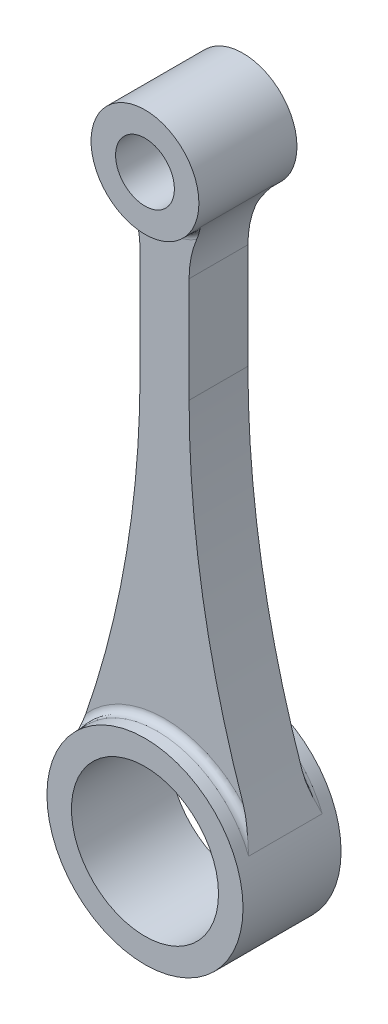
ISO-10303-21;
HEADER;
FILE_DESCRIPTION(('STEP AP214'),'2;1');
FILE_NAME('part.step','',(''),(''),'','','');
FILE_SCHEMA(('AUTOMOTIVE_DESIGN { 1 0 10303 214 1 1 1 1 }'));
ENDSEC;
DATA;
#1=APPLICATION_CONTEXT('core data for automotive mechanical design processes');
#2=APPLICATION_PROTOCOL_DEFINITION('international standard','automotive_design',2000,#1);
#3=PRODUCT_CONTEXT('',#1,'mechanical');
#4=PRODUCT('Part','Part','',(#3));
#5=PRODUCT_RELATED_PRODUCT_CATEGORY('part','',(#4));
#6=PRODUCT_DEFINITION_FORMATION('','',#4);
#7=PRODUCT_DEFINITION_CONTEXT('part definition',#1,'design');
#8=PRODUCT_DEFINITION('design','',#6,#7);
#9=PRODUCT_DEFINITION_SHAPE('','',#8);
#10=(LENGTH_UNIT() NAMED_UNIT(*) SI_UNIT(.MILLI.,.METRE.));
#11=(NAMED_UNIT(*) PLANE_ANGLE_UNIT() SI_UNIT($,.RADIAN.));
#12=(NAMED_UNIT(*) SI_UNIT($,.STERADIAN.) SOLID_ANGLE_UNIT());
#13=UNCERTAINTY_MEASURE_WITH_UNIT(LENGTH_MEASURE(1.E-05),#10,'distance_accuracy_value','');
#14=(GEOMETRIC_REPRESENTATION_CONTEXT(3) GLOBAL_UNCERTAINTY_ASSIGNED_CONTEXT((#13)) GLOBAL_UNIT_ASSIGNED_CONTEXT((#10,
#11,#12)) REPRESENTATION_CONTEXT('',''));
#15=CARTESIAN_POINT('',(0.,0.,0.));
#16=DIRECTION('',(0.,0.,1.));
#17=DIRECTION('',(1.,0.,0.));
#18=AXIS2_PLACEMENT_3D('',#15,#16,#17);
#19=CARTESIAN_POINT('',(0.,0.,10.));
#20=DIRECTION('',(0.,0.,1.));
#21=DIRECTION('',(1.,0.,0.));
#22=AXIS2_PLACEMENT_3D('',#19,#20,#21);
#23=PLANE('',#22);
#24=CARTESIAN_POINT('',(0.,0.,10.));
#25=DIRECTION('',(0.,0.,1.));
#26=DIRECTION('',(1.,0.,0.));
#27=AXIS2_PLACEMENT_3D('',#24,#25,#26);
#28=CIRCLE('',#27,20.);
#29=CARTESIAN_POINT('',(20.,0.,10.));
#30=VERTEX_POINT('',#29);
#31=EDGE_CURVE('E209',#30,#30,#28,.T.);
#32=ORIENTED_EDGE('',*,*,#31,.T.);
#33=EDGE_LOOP('',(#32));
#34=FACE_BOUND('',#33,.T.);
#35=CARTESIAN_POINT('',(0.,0.,10.));
#36=DIRECTION('',(0.,0.,1.));
#37=DIRECTION('',(1.,0.,0.));
#38=AXIS2_PLACEMENT_3D('',#35,#36,#37);
#39=CIRCLE('',#38,15.);
#40=CARTESIAN_POINT('',(15.,0.,10.));
#41=VERTEX_POINT('',#40);
#42=EDGE_CURVE('E201',#41,#41,#39,.T.);
#43=ORIENTED_EDGE('',*,*,#42,.F.);
#44=EDGE_LOOP('',(#43));
#45=FACE_BOUND('',#44,.T.);
#46=ADVANCED_FACE('F43',(#34,#45),#23,.T.);
#47=CARTESIAN_POINT('',(0.,0.,-10.));
#48=DIRECTION('',(0.,0.,1.));
#49=DIRECTION('',(1.,0.,0.));
#50=AXIS2_PLACEMENT_3D('',#47,#48,#49);
#51=PLANE('',#50);
#52=CARTESIAN_POINT('',(0.,0.,-10.));
#53=DIRECTION('',(0.,0.,1.));
#54=DIRECTION('',(1.,0.,0.));
#55=AXIS2_PLACEMENT_3D('',#52,#53,#54);
#56=CIRCLE('',#55,20.);
#57=CARTESIAN_POINT('',(20.,0.,-10.));
#58=VERTEX_POINT('',#57);
#59=EDGE_CURVE('E205',#58,#58,#56,.T.);
#60=ORIENTED_EDGE('',*,*,#59,.F.);
#61=EDGE_LOOP('',(#60));
#62=FACE_BOUND('',#61,.T.);
#63=CARTESIAN_POINT('',(0.,0.,-10.));
#64=DIRECTION('',(0.,0.,1.));
#65=DIRECTION('',(1.,0.,0.));
#66=AXIS2_PLACEMENT_3D('',#63,#64,#65);
#67=CIRCLE('',#66,15.);
#68=CARTESIAN_POINT('',(15.,0.,-10.));
#69=VERTEX_POINT('',#68);
#70=EDGE_CURVE('E163',#69,#69,#67,.T.);
#71=ORIENTED_EDGE('',*,*,#70,.T.);
#72=EDGE_LOOP('',(#71));
#73=FACE_BOUND('',#72,.T.);
#74=ADVANCED_FACE('F392',(#62,#73),#51,.F.);
#75=CARTESIAN_POINT('',(0.,0.,10.));
#76=DIRECTION('',(0.,0.,-1.));
#77=DIRECTION('',(-1.,0.,0.));
#78=AXIS2_PLACEMENT_3D('',#75,#76,#77);
#79=CYLINDRICAL_SURFACE('',#78,20.);
#80=CARTESIAN_POINT('',(0.,0.,-7.5));
#81=DIRECTION('',(0.,0.,1.));
#82=DIRECTION('',(1.,0.,0.));
#83=AXIS2_PLACEMENT_3D('',#80,#81,#82);
#84=CIRCLE('',#83,20.);
#85=CARTESIAN_POINT('',(-18.6481142651054,7.22826634509118,-7.5));
#86=VERTEX_POINT('',#85);
#87=CARTESIAN_POINT('',(18.6481142651052,7.22826634509124,-7.5));
#88=VERTEX_POINT('',#87);
#89=EDGE_CURVE('E230',#86,#88,#84,.F.);
#90=ORIENTED_EDGE('',*,*,#89,.T.);
#91=DIRECTION('',(0.,0.,-1.));
#92=VECTOR('',#91,1.);
#93=CARTESIAN_POINT('',(18.6481142651053,7.22826634509126,6.));
#94=LINE('',#93,#92);
#95=CARTESIAN_POINT('',(18.6481142651052,7.22826634509124,7.5));
#96=VERTEX_POINT('',#95);
#97=EDGE_CURVE('E196',#96,#88,#94,.T.);
#98=ORIENTED_EDGE('',*,*,#97,.F.);
#99=CARTESIAN_POINT('',(0.,0.,7.5));
#100=DIRECTION('',(0.,0.,1.));
#101=DIRECTION('',(1.,0.,0.));
#102=AXIS2_PLACEMENT_3D('',#99,#100,#101);
#103=CIRCLE('',#102,20.);
#104=CARTESIAN_POINT('',(-18.6481142651054,7.22826634509118,7.5));
#105=VERTEX_POINT('',#104);
#106=EDGE_CURVE('E226',#96,#105,#103,.T.);
#107=ORIENTED_EDGE('',*,*,#106,.T.);
#108=DIRECTION('',(0.,0.,-1.));
#109=VECTOR('',#108,1.);
#110=CARTESIAN_POINT('',(-18.6481142651054,7.22826634509118,6.));
#111=LINE('',#110,#109);
#112=EDGE_CURVE('E164',#105,#86,#111,.T.);
#113=ORIENTED_EDGE('',*,*,#112,.T.);
#114=EDGE_LOOP('',(#90,#98,#107,#113));
#115=FACE_BOUND('',#114,.T.);
#116=ORIENTED_EDGE('',*,*,#31,.F.);
#117=EDGE_LOOP('',(#116));
#118=FACE_BOUND('',#117,.T.);
#119=ORIENTED_EDGE('',*,*,#59,.T.);
#120=EDGE_LOOP('',(#119));
#121=FACE_BOUND('',#120,.T.);
#122=ADVANCED_FACE('F315',(#115,#118,#121),#79,.T.);
#123=CARTESIAN_POINT('',(0.,0.,10.));
#124=DIRECTION('',(0.,0.,-1.));
#125=DIRECTION('',(-1.,0.,0.));
#126=AXIS2_PLACEMENT_3D('',#123,#124,#125);
#127=CYLINDRICAL_SURFACE('',#126,15.);
#128=ORIENTED_EDGE('',*,*,#42,.T.);
#129=EDGE_LOOP('',(#128));
#130=FACE_BOUND('',#129,.T.);
#131=ORIENTED_EDGE('',*,*,#70,.F.);
#132=EDGE_LOOP('',(#131));
#133=FACE_BOUND('',#132,.T.);
#134=ADVANCED_FACE('F401',(#130,#133),#127,.F.);
#135=CARTESIAN_POINT('',(-5.00000000000001,110.202041028867,6.));
#136=DIRECTION('',(1.,0.,0.));
#137=DIRECTION('',(0.,0.,-1.));
#138=AXIS2_PLACEMENT_3D('',#135,#136,#137);
#139=PLANE('',#138);
#140=DIRECTION('',(0.,-1.,0.));
#141=VECTOR('',#140,1.);
#142=CARTESIAN_POINT('',(-5.00000000000001,110.202041028867,6.));
#143=LINE('',#142,#141);
#144=CARTESIAN_POINT('',(-5.00000000000001,101.669697220177,6.));
#145=VERTEX_POINT('',#144);
#146=CARTESIAN_POINT('',(-5.,80.2020410288673,6.));
#147=VERTEX_POINT('',#146);
#148=EDGE_CURVE('E139',#145,#147,#143,.T.);
#149=ORIENTED_EDGE('',*,*,#148,.F.);
#150=DIRECTION('',(0.,0.,1.));
#151=VECTOR('',#150,1.);
#152=CARTESIAN_POINT('',(-5.00000000000001,101.669697220177,-7.5));
#153=LINE('',#152,#151);
#154=CARTESIAN_POINT('',(-5.00000000000001,101.669697220177,-6.));
#155=VERTEX_POINT('',#154);
#156=EDGE_CURVE('E353',#145,#155,#153,.F.);
#157=ORIENTED_EDGE('',*,*,#156,.T.);
#158=DIRECTION('',(0.,-1.,0.));
#159=VECTOR('',#158,1.);
#160=CARTESIAN_POINT('',(-5.00000000000001,110.202041028867,-6.));
#161=LINE('',#160,#159);
#162=CARTESIAN_POINT('',(-5.,80.2020410288673,-6.));
#163=VERTEX_POINT('',#162);
#164=EDGE_CURVE('E158',#155,#163,#161,.T.);
#165=ORIENTED_EDGE('',*,*,#164,.T.);
#166=DIRECTION('',(0.,0.,-1.));
#167=VECTOR('',#166,1.);
#168=CARTESIAN_POINT('',(-5.,80.2020410288673,6.));
#169=LINE('',#168,#167);
#170=EDGE_CURVE('E155',#147,#163,#169,.T.);
#171=ORIENTED_EDGE('',*,*,#170,.F.);
#172=EDGE_LOOP('',(#149,#157,#165,#171));
#173=FACE_BOUND('',#172,.T.);
#174=ADVANCED_FACE('F156',(#173),#139,.F.);
#175=CARTESIAN_POINT('',(-206.912246173203,80.2020410288673,6.));
#176=DIRECTION('',(0.,0.,-1.));
#177=DIRECTION('',(-1.,0.,0.));
#178=AXIS2_PLACEMENT_3D('',#175,#176,#177);
#179=CYLINDRICAL_SURFACE('',#178,201.912246173203);
#180=CARTESIAN_POINT('',(-206.912246173203,80.2020410288673,-6.));
#181=DIRECTION('',(0.,0.,-1.));
#182=DIRECTION('',(-1.,0.,0.));
#183=AXIS2_PLACEMENT_3D('',#180,#181,#182);
#184=CIRCLE('',#183,201.912246173203);
#185=CARTESIAN_POINT('',(-16.0593915870728,14.2949621144324,-6.));
#186=VERTEX_POINT('',#185);
#187=EDGE_CURVE('E183',#163,#186,#184,.T.);
#188=ORIENTED_EDGE('',*,*,#187,.T.);
#189=CARTESIAN_POINT('',(-16.0593915870727,14.2949621144324,-6.));
#190=CARTESIAN_POINT('',(-16.1006536952659,14.1754753958476,-6.00001602232113));
#191=CARTESIAN_POINT('',(-16.1420221672785,14.056045230027,-6.00236364174537));
#192=CARTESIAN_POINT('',(-16.2249250693881,13.8174294281598,-6.01122841546089));
#193=CARTESIAN_POINT('',(-16.2664594535359,13.6982437366055,-6.01774448543559));
#194=CARTESIAN_POINT('',(-16.3496188353365,13.4603293139476,-6.03444296750452));
#195=CARTESIAN_POINT('',(-16.3912436637816,13.3416002055262,-6.04462095780392));
#196=CARTESIAN_POINT('',(-16.4746143558737,13.1045050433237,-6.06824871525979));
#197=CARTESIAN_POINT('',(-16.5163602282174,12.9861390169526,-6.08169872355933));
#198=CARTESIAN_POINT('',(-16.6413582816418,12.6327683299967,-6.12627700219281));
#199=CARTESIAN_POINT('',(-16.7247668152694,12.3983585047964,-6.16172009800412));
#200=CARTESIAN_POINT('',(-16.8919587539801,11.9312046260805,-6.24186223068177));
#201=CARTESIAN_POINT('',(-16.9757422854805,11.6984612159068,-6.28656466187015));
#202=CARTESIAN_POINT('',(-17.1890070534452,11.1094074843406,-6.40949821500616));
#203=CARTESIAN_POINT('',(-17.3187304550148,10.7542484759799,-6.49279850830727));
#204=CARTESIAN_POINT('',(-17.5791415039699,10.0474088872037,-6.67147800947545));
#205=CARTESIAN_POINT('',(-17.709829167929,9.69572836682037,-6.76685742541474));
#206=CARTESIAN_POINT('',(-18.1041013686584,8.64365924993022,-7.06469767397822));
#207=CARTESIAN_POINT('',(-18.3695278193437,7.94725690788739,-7.27862120648419));
#208=CARTESIAN_POINT('',(-18.6418666749919,7.24438596708687,-7.4950365601862));
#209=CARTESIAN_POINT('',(-18.6449902140362,7.23632605190464,-7.49751829132441));
#210=CARTESIAN_POINT('',(-18.6481142651053,7.22826634509117,-7.5));
#211=B_SPLINE_CURVE_WITH_KNOTS('',3,(#189,#190,#191,#192,#193,#194,#195,#196,#197,#198,#199,
#200,#201,#202,#203,#204,#205,#206,#207,#208,#209,#210),.UNSPECIFIED.,.F.,.F.,(4,2,2,2,2,2,2,2,
2,2,4),(0.,0.379183324232442,0.7582680536355,1.13689656340839,1.51555298602283,2.26926103821077,
3.0232458780853,4.1844383765462,5.34565088016549,7.67138597053306,7.69836558191351),.UNSPECIFIED.);
#212=EDGE_CURVE('E249',#186,#86,#211,.T.);
#213=ORIENTED_EDGE('',*,*,#212,.T.);
#214=ORIENTED_EDGE('',*,*,#112,.F.);
#215=CARTESIAN_POINT('',(-16.0593915870727,14.2949621144324,6.));
#216=CARTESIAN_POINT('',(-16.1006536952659,14.1754753958476,6.00001602232113));
#217=CARTESIAN_POINT('',(-16.1420221672785,14.056045230027,6.00236364174537));
#218=CARTESIAN_POINT('',(-16.2249250693881,13.8174294281598,6.01122841546089));
#219=CARTESIAN_POINT('',(-16.2664594535359,13.6982437366055,6.01774448543559));
#220=CARTESIAN_POINT('',(-16.3496188353365,13.4603293139476,6.03444296750451));
#221=CARTESIAN_POINT('',(-16.3912436637816,13.3416002055262,6.04462095780391));
#222=CARTESIAN_POINT('',(-16.4746143558737,13.1045050433237,6.06824871525978));
#223=CARTESIAN_POINT('',(-16.5163602282174,12.9861390169526,6.08169872355933));
#224=CARTESIAN_POINT('',(-16.6413582816418,12.6327683299967,6.12627700219281));
#225=CARTESIAN_POINT('',(-16.7247668152694,12.3983585047964,6.16172009800413));
#226=CARTESIAN_POINT('',(-16.8919587539801,11.9312046260805,6.24186223068177));
#227=CARTESIAN_POINT('',(-16.9757422854805,11.6984612159068,6.28656466187015));
#228=CARTESIAN_POINT('',(-17.1890070534452,11.1094074843406,6.40949821500616));
#229=CARTESIAN_POINT('',(-17.3187304550148,10.7542484759799,6.49279850830727));
#230=CARTESIAN_POINT('',(-17.5791415039699,10.0474088872037,6.67147800947545));
#231=CARTESIAN_POINT('',(-17.709829167929,9.69572836682037,6.76685742541474));
#232=CARTESIAN_POINT('',(-18.1041013686584,8.64365924993022,7.06469767397822));
#233=CARTESIAN_POINT('',(-18.3695278193437,7.94725690788739,7.27862120648419));
#234=CARTESIAN_POINT('',(-18.6418666749919,7.24438596708687,7.4950365601862));
#235=CARTESIAN_POINT('',(-18.6449902140362,7.23632605190464,7.49751829132441));
#236=CARTESIAN_POINT('',(-18.6481142651053,7.22826634509117,7.5));
#237=B_SPLINE_CURVE_WITH_KNOTS('',3,(#215,#216,#217,#218,#219,#220,#221,#222,#223,#224,#225,
#226,#227,#228,#229,#230,#231,#232,#233,#234,#235,#236),.UNSPECIFIED.,.F.,.F.,(4,2,2,2,2,2,2,2,
2,2,4),(0.,0.379183324232441,0.7582680536355,1.13689656340839,1.51555298602283,2.26926103821077,
3.0232458780853,4.18443837654619,5.34565088016549,7.67138597053305,7.6983655819135),.UNSPECIFIED.);
#238=CARTESIAN_POINT('',(-16.0593915870728,14.2949621144324,6.));
#239=VERTEX_POINT('',#238);
#240=EDGE_CURVE('E168',#105,#239,#237,.F.);
#241=ORIENTED_EDGE('',*,*,#240,.T.);
#242=CARTESIAN_POINT('',(-206.912246173203,80.2020410288673,6.));
#243=DIRECTION('',(0.,0.,-1.));
#244=DIRECTION('',(-1.,0.,0.));
#245=AXIS2_PLACEMENT_3D('',#242,#243,#244);
#246=CIRCLE('',#245,201.912246173203);
#247=EDGE_CURVE('E144',#147,#239,#246,.T.);
#248=ORIENTED_EDGE('',*,*,#247,.F.);
#249=ORIENTED_EDGE('',*,*,#170,.T.);
#250=EDGE_LOOP('',(#188,#213,#214,#241,#248,#249));
#251=FACE_BOUND('',#250,.T.);
#252=ADVANCED_FACE('F166',(#251),#179,.F.);
#253=CARTESIAN_POINT('',(206.912246173203,80.2020410288673,6.));
#254=DIRECTION('',(0.,0.,-1.));
#255=DIRECTION('',(-1.,0.,0.));
#256=AXIS2_PLACEMENT_3D('',#253,#254,#255);
#257=CYLINDRICAL_SURFACE('',#256,201.912246173203);
#258=ORIENTED_EDGE('',*,*,#97,.T.);
#259=CARTESIAN_POINT('',(16.0593915870727,14.2949621144324,-6.));
#260=CARTESIAN_POINT('',(16.1006536952661,14.1754753958471,-6.00001602232113));
#261=CARTESIAN_POINT('',(16.1420221672788,14.056045230026,-6.00236364174539));
#262=CARTESIAN_POINT('',(16.2249250693887,13.8174294281579,-6.01122841546098));
#263=CARTESIAN_POINT('',(16.2664594535367,13.698243736603,-6.01774448543573));
#264=CARTESIAN_POINT('',(16.3496188353377,13.4603293139443,-6.03444296750478));
#265=CARTESIAN_POINT('',(16.3912436637829,13.3416002055225,-6.04462095780425));
#266=CARTESIAN_POINT('',(16.4746143558753,13.1045050433192,-6.06824871526027));
#267=CARTESIAN_POINT('',(16.5163602282191,12.9861390169477,-6.0816987235599));
#268=CARTESIAN_POINT('',(16.6413582816433,12.6327683299925,-6.12627700219345));
#269=CARTESIAN_POINT('',(16.7247668152706,12.3983585047931,-6.16172009800472));
#270=CARTESIAN_POINT('',(16.8919587539807,11.9312046260789,-6.24186223068201));
#271=CARTESIAN_POINT('',(16.9757422854808,11.698461215906,-6.28656466187009));
#272=CARTESIAN_POINT('',(17.1890070534451,11.1094074843408,-6.40949821500648));
#273=CARTESIAN_POINT('',(17.3187304550145,10.7542484759806,-6.49279850830881));
#274=CARTESIAN_POINT('',(17.5791415039697,10.0474088872041,-6.67147800947363));
#275=CARTESIAN_POINT('',(17.7098291679292,9.69572836682001,-6.76685742540831));
#276=CARTESIAN_POINT('',(18.1041013686566,8.64365924993462,-7.06469767399014));
#277=CARTESIAN_POINT('',(18.3695278193359,7.9472569079058,-7.278621206551));
#278=CARTESIAN_POINT('',(18.6418666749916,7.24438596708744,-7.49503656018771));
#279=CARTESIAN_POINT('',(18.6449902140361,7.23632605190492,-7.49751829132517));
#280=CARTESIAN_POINT('',(18.6481142651053,7.22826634509117,-7.5));
#281=B_SPLINE_CURVE_WITH_KNOTS('',3,(#259,#260,#261,#262,#263,#264,#265,#266,#267,#268,#269,
#270,#271,#272,#273,#274,#275,#276,#277,#278,#279,#280),.UNSPECIFIED.,.F.,.F.,(4,2,2,2,2,2,2,2,
2,2,4),(0.,0.379183324234002,0.758268053638621,1.13689656341274,1.51555298602839,
2.26926103821337,3.0232458780853,4.18443837654569,5.34565088016369,7.67138597053278,
7.69836558191349),.UNSPECIFIED.);
#282=CARTESIAN_POINT('',(16.0593915870728,14.2949621144324,-6.));
#283=VERTEX_POINT('',#282);
#284=EDGE_CURVE('E240',#88,#283,#281,.F.);
#285=ORIENTED_EDGE('',*,*,#284,.T.);
#286=CARTESIAN_POINT('',(206.912246173203,80.2020410288673,-6.));
#287=DIRECTION('',(0.,0.,-1.));
#288=DIRECTION('',(1.,0.,0.));
#289=AXIS2_PLACEMENT_3D('',#286,#287,#288);
#290=CIRCLE('',#289,201.912246173203);
#291=CARTESIAN_POINT('',(4.99999999999999,80.2020410288673,-6.));
#292=VERTEX_POINT('',#291);
#293=EDGE_CURVE('E187',#283,#292,#290,.T.);
#294=ORIENTED_EDGE('',*,*,#293,.T.);
#295=DIRECTION('',(0.,0.,-1.));
#296=VECTOR('',#295,1.);
#297=CARTESIAN_POINT('',(4.99999999999999,80.2020410288673,6.));
#298=LINE('',#297,#296);
#299=CARTESIAN_POINT('',(4.99999999999999,80.2020410288673,6.));
#300=VERTEX_POINT('',#299);
#301=EDGE_CURVE('E180',#300,#292,#298,.T.);
#302=ORIENTED_EDGE('',*,*,#301,.F.);
#303=CARTESIAN_POINT('',(206.912246173203,80.2020410288673,6.));
#304=DIRECTION('',(0.,0.,-1.));
#305=DIRECTION('',(1.,0.,0.));
#306=AXIS2_PLACEMENT_3D('',#303,#304,#305);
#307=CIRCLE('',#306,201.912246173203);
#308=CARTESIAN_POINT('',(16.0593915870728,14.2949621144324,6.));
#309=VERTEX_POINT('',#308);
#310=EDGE_CURVE('E170',#309,#300,#307,.T.);
#311=ORIENTED_EDGE('',*,*,#310,.F.);
#312=CARTESIAN_POINT('',(16.0593915870727,14.2949621144324,6.));
#313=CARTESIAN_POINT('',(16.1006536952661,14.1754753958471,6.00001602232113));
#314=CARTESIAN_POINT('',(16.1420221672788,14.056045230026,6.00236364174539));
#315=CARTESIAN_POINT('',(16.2249250693887,13.8174294281579,6.01122841546097));
#316=CARTESIAN_POINT('',(16.2664594535367,13.698243736603,6.01774448543573));
#317=CARTESIAN_POINT('',(16.3496188353377,13.4603293139443,6.03444296750478));
#318=CARTESIAN_POINT('',(16.3912436637829,13.3416002055225,6.04462095780425));
#319=CARTESIAN_POINT('',(16.4746143558753,13.1045050433192,6.06824871526027));
#320=CARTESIAN_POINT('',(16.5163602282191,12.9861390169477,6.0816987235599));
#321=CARTESIAN_POINT('',(16.6413582816433,12.6327683299925,6.12627700219345));
#322=CARTESIAN_POINT('',(16.7247668152706,12.3983585047931,6.16172009800472));
#323=CARTESIAN_POINT('',(16.8919587539807,11.9312046260789,6.24186223068201));
#324=CARTESIAN_POINT('',(16.9757422854808,11.698461215906,6.28656466187009));
#325=CARTESIAN_POINT('',(17.1890070534451,11.1094074843408,6.40949821500648));
#326=CARTESIAN_POINT('',(17.3187304550145,10.7542484759806,6.49279850830881));
#327=CARTESIAN_POINT('',(17.5791415039697,10.0474088872041,6.67147800947363));
#328=CARTESIAN_POINT('',(17.7098291679292,9.69572836682,6.76685742540831));
#329=CARTESIAN_POINT('',(18.1041013686566,8.64365924993462,7.06469767399014));
#330=CARTESIAN_POINT('',(18.3695278193359,7.9472569079058,7.278621206551));
#331=CARTESIAN_POINT('',(18.6418666749916,7.24438596708744,7.4950365601877));
#332=CARTESIAN_POINT('',(18.6449902140361,7.23632605190492,7.49751829132517));
#333=CARTESIAN_POINT('',(18.6481142651053,7.22826634509117,7.5));
#334=B_SPLINE_CURVE_WITH_KNOTS('',3,(#312,#313,#314,#315,#316,#317,#318,#319,#320,#321,#322,
#323,#324,#325,#326,#327,#328,#329,#330,#331,#332,#333),.UNSPECIFIED.,.F.,.F.,(4,2,2,2,2,2,2,2,
2,2,4),(0.,0.379183324234002,0.758268053638617,1.13689656341274,1.51555298602839,
2.26926103821337,3.0232458780853,4.18443837654569,5.34565088016369,7.67138597053278,
7.69836558191349),.UNSPECIFIED.);
#335=EDGE_CURVE('E270',#309,#96,#334,.T.);
#336=ORIENTED_EDGE('',*,*,#335,.T.);
#337=EDGE_LOOP('',(#258,#285,#294,#302,#311,#336));
#338=FACE_BOUND('',#337,.T.);
#339=ADVANCED_FACE('F260',(#338),#257,.F.);
#340=CARTESIAN_POINT('',(4.99999999999999,110.202041028867,6.));
#341=DIRECTION('',(-1.,0.,0.));
#342=DIRECTION('',(0.,-1.,0.));
#343=AXIS2_PLACEMENT_3D('',#340,#341,#342);
#344=PLANE('',#343);
#345=DIRECTION('',(0.,1.,0.));
#346=VECTOR('',#345,1.);
#347=CARTESIAN_POINT('',(4.99999999999999,110.202041028867,-6.));
#348=LINE('',#347,#346);
#349=CARTESIAN_POINT('',(4.99999999999999,101.669697220177,-6.));
#350=VERTEX_POINT('',#349);
#351=EDGE_CURVE('E152',#292,#350,#348,.T.);
#352=ORIENTED_EDGE('',*,*,#351,.T.);
#353=DIRECTION('',(0.,0.,1.));
#354=VECTOR('',#353,1.);
#355=CARTESIAN_POINT('',(4.99999999999999,101.669697220177,7.5));
#356=LINE('',#355,#354);
#357=CARTESIAN_POINT('',(4.99999999999999,101.669697220177,6.));
#358=VERTEX_POINT('',#357);
#359=EDGE_CURVE('E351',#350,#358,#356,.T.);
#360=ORIENTED_EDGE('',*,*,#359,.T.);
#361=DIRECTION('',(0.,1.,0.));
#362=VECTOR('',#361,1.);
#363=CARTESIAN_POINT('',(4.99999999999999,110.202041028867,6.));
#364=LINE('',#363,#362);
#365=EDGE_CURVE('E173',#300,#358,#364,.T.);
#366=ORIENTED_EDGE('',*,*,#365,.F.);
#367=ORIENTED_EDGE('',*,*,#301,.T.);
#368=EDGE_LOOP('',(#352,#360,#366,#367));
#369=FACE_BOUND('',#368,.T.);
#370=ADVANCED_FACE('F264',(#369),#344,.F.);
#371=CARTESIAN_POINT('',(0.,120.,6.));
#372=DIRECTION('',(0.,0.,1.));
#373=DIRECTION('',(1.,0.,0.));
#374=AXIS2_PLACEMENT_3D('',#371,#372,#373);
#375=PLANE('',#374);
#376=ORIENTED_EDGE('',*,*,#247,.T.);
#377=CARTESIAN_POINT('',(0.,0.,6.));
#378=DIRECTION('',(0.,0.,1.));
#379=DIRECTION('',(1.,0.,0.));
#380=AXIS2_PLACEMENT_3D('',#377,#378,#379);
#381=CIRCLE('',#380,21.5);
#382=EDGE_CURVE('E237',#239,#309,#381,.F.);
#383=ORIENTED_EDGE('',*,*,#382,.T.);
#384=ORIENTED_EDGE('',*,*,#310,.T.);
#385=ORIENTED_EDGE('',*,*,#365,.T.);
#386=CARTESIAN_POINT('',(25.,101.669697220177,6.));
#387=DIRECTION('',(0.,0.,1.));
#388=DIRECTION('',(1.,0.,0.));
#389=AXIS2_PLACEMENT_3D('',#386,#387,#388);
#390=CIRCLE('',#389,20.);
#391=CARTESIAN_POINT('',(6.5297645385134,109.341098786856,6.));
#392=VERTEX_POINT('',#391);
#393=EDGE_CURVE('E58',#358,#392,#390,.F.);
#394=ORIENTED_EDGE('',*,*,#393,.T.);
#395=CARTESIAN_POINT('',(0.,120.,6.));
#396=DIRECTION('',(0.,0.,1.));
#397=DIRECTION('',(1.,0.,0.));
#398=AXIS2_PLACEMENT_3D('',#395,#396,#397);
#399=CIRCLE('',#398,12.5);
#400=CARTESIAN_POINT('',(-6.52976453851342,109.341098786856,6.));
#401=VERTEX_POINT('',#400);
#402=EDGE_CURVE('E64',#392,#401,#399,.F.);
#403=ORIENTED_EDGE('',*,*,#402,.T.);
#404=CARTESIAN_POINT('',(-25.,101.669697220177,6.));
#405=DIRECTION('',(0.,0.,1.));
#406=DIRECTION('',(1.,0.,0.));
#407=AXIS2_PLACEMENT_3D('',#404,#405,#406);
#408=CIRCLE('',#407,20.);
#409=EDGE_CURVE('E147',#401,#145,#408,.F.);
#410=ORIENTED_EDGE('',*,*,#409,.T.);
#411=ORIENTED_EDGE('',*,*,#148,.T.);
#412=EDGE_LOOP('',(#376,#383,#384,#385,#394,#403,#410,#411));
#413=FACE_BOUND('',#412,.T.);
#414=ADVANCED_FACE('F141',(#413),#375,.T.);
#415=CARTESIAN_POINT('',(0.,120.,-6.));
#416=DIRECTION('',(0.,0.,1.));
#417=DIRECTION('',(1.,0.,0.));
#418=AXIS2_PLACEMENT_3D('',#415,#416,#417);
#419=PLANE('',#418);
#420=ORIENTED_EDGE('',*,*,#293,.F.);
#421=CARTESIAN_POINT('',(0.,0.,-6.));
#422=DIRECTION('',(0.,0.,1.));
#423=DIRECTION('',(1.,0.,0.));
#424=AXIS2_PLACEMENT_3D('',#421,#422,#423);
#425=CIRCLE('',#424,21.5);
#426=EDGE_CURVE('E234',#283,#186,#425,.T.);
#427=ORIENTED_EDGE('',*,*,#426,.T.);
#428=ORIENTED_EDGE('',*,*,#187,.F.);
#429=ORIENTED_EDGE('',*,*,#164,.F.);
#430=CARTESIAN_POINT('',(-25.,101.669697220177,-6.));
#431=DIRECTION('',(0.,0.,1.));
#432=DIRECTION('',(1.,0.,0.));
#433=AXIS2_PLACEMENT_3D('',#430,#431,#432);
#434=CIRCLE('',#433,20.);
#435=CARTESIAN_POINT('',(-6.52976453851342,109.341098786856,-6.));
#436=VERTEX_POINT('',#435);
#437=EDGE_CURVE('E357',#155,#436,#434,.T.);
#438=ORIENTED_EDGE('',*,*,#437,.T.);
#439=CARTESIAN_POINT('',(0.,120.,-6.));
#440=DIRECTION('',(0.,0.,1.));
#441=DIRECTION('',(1.,0.,0.));
#442=AXIS2_PLACEMENT_3D('',#439,#440,#441);
#443=CIRCLE('',#442,12.5);
#444=CARTESIAN_POINT('',(6.5297645385134,109.341098786856,-6.));
#445=VERTEX_POINT('',#444);
#446=EDGE_CURVE('E72',#436,#445,#443,.T.);
#447=ORIENTED_EDGE('',*,*,#446,.T.);
#448=CARTESIAN_POINT('',(25.,101.669697220177,-6.));
#449=DIRECTION('',(0.,0.,1.));
#450=DIRECTION('',(1.,0.,0.));
#451=AXIS2_PLACEMENT_3D('',#448,#449,#450);
#452=CIRCLE('',#451,20.);
#453=EDGE_CURVE('E329',#445,#350,#452,.T.);
#454=ORIENTED_EDGE('',*,*,#453,.T.);
#455=ORIENTED_EDGE('',*,*,#351,.F.);
#456=EDGE_LOOP('',(#420,#427,#428,#429,#438,#447,#454,#455));
#457=FACE_BOUND('',#456,.T.);
#458=ADVANCED_FACE('F380',(#457),#419,.F.);
#459=CARTESIAN_POINT('',(0.,120.,10.));
#460=DIRECTION('',(0.,0.,1.));
#461=DIRECTION('',(1.,0.,0.));
#462=AXIS2_PLACEMENT_3D('',#459,#460,#461);
#463=PLANE('',#462);
#464=CARTESIAN_POINT('',(0.,120.,10.));
#465=DIRECTION('',(0.,0.,1.));
#466=DIRECTION('',(1.,0.,0.));
#467=AXIS2_PLACEMENT_3D('',#464,#465,#466);
#468=CIRCLE('',#467,11.);
#469=CARTESIAN_POINT('',(11.,120.,10.));
#470=VERTEX_POINT('',#469);
#471=EDGE_CURVE('E562',#470,#470,#468,.T.);
#472=ORIENTED_EDGE('',*,*,#471,.T.);
#473=EDGE_LOOP('',(#472));
#474=FACE_BOUND('',#473,.T.);
#475=CARTESIAN_POINT('',(0.,120.,10.));
#476=DIRECTION('',(0.,0.,1.));
#477=DIRECTION('',(1.,0.,0.));
#478=AXIS2_PLACEMENT_3D('',#475,#476,#477);
#479=CIRCLE('',#478,6.);
#480=CARTESIAN_POINT('',(6.,120.,10.));
#481=VERTEX_POINT('',#480);
#482=EDGE_CURVE('E557',#481,#481,#479,.T.);
#483=ORIENTED_EDGE('',*,*,#482,.F.);
#484=EDGE_LOOP('',(#483));
#485=FACE_BOUND('',#484,.T.);
#486=ADVANCED_FACE('F382',(#474,#485),#463,.T.);
#487=CARTESIAN_POINT('',(0.,120.,-10.));
#488=DIRECTION('',(0.,0.,1.));
#489=DIRECTION('',(1.,0.,0.));
#490=AXIS2_PLACEMENT_3D('',#487,#488,#489);
#491=PLANE('',#490);
#492=CARTESIAN_POINT('',(0.,120.,-10.));
#493=DIRECTION('',(0.,0.,1.));
#494=DIRECTION('',(1.,0.,0.));
#495=AXIS2_PLACEMENT_3D('',#492,#493,#494);
#496=CIRCLE('',#495,11.);
#497=CARTESIAN_POINT('',(11.,120.,-10.));
#498=VERTEX_POINT('',#497);
#499=EDGE_CURVE('E552',#498,#498,#496,.T.);
#500=ORIENTED_EDGE('',*,*,#499,.F.);
#501=EDGE_LOOP('',(#500));
#502=FACE_BOUND('',#501,.T.);
#503=CARTESIAN_POINT('',(0.,120.,-10.));
#504=DIRECTION('',(0.,0.,1.));
#505=DIRECTION('',(1.,0.,0.));
#506=AXIS2_PLACEMENT_3D('',#503,#504,#505);
#507=CIRCLE('',#506,6.);
#508=CARTESIAN_POINT('',(6.,120.,-10.));
#509=VERTEX_POINT('',#508);
#510=EDGE_CURVE('E184',#509,#509,#507,.T.);
#511=ORIENTED_EDGE('',*,*,#510,.T.);
#512=EDGE_LOOP('',(#511));
#513=FACE_BOUND('',#512,.T.);
#514=ADVANCED_FACE('F387',(#502,#513),#491,.F.);
#515=CARTESIAN_POINT('',(0.,120.,10.));
#516=DIRECTION('',(0.,0.,-1.));
#517=DIRECTION('',(-1.,0.,0.));
#518=AXIS2_PLACEMENT_3D('',#515,#516,#517);
#519=CYLINDRICAL_SURFACE('',#518,11.);
#520=CARTESIAN_POINT('',(0.,120.,-7.5));
#521=DIRECTION('',(0.,0.,1.));
#522=DIRECTION('',(1.,0.,0.));
#523=AXIS2_PLACEMENT_3D('',#520,#521,#522);
#524=CIRCLE('',#523,11.);
#525=CARTESIAN_POINT('',(8.87096774193548,113.495699013611,-7.5));
#526=VERTEX_POINT('',#525);
#527=CARTESIAN_POINT('',(-8.87096774193549,113.495699013611,-7.5));
#528=VERTEX_POINT('',#527);
#529=EDGE_CURVE('E218',#526,#528,#524,.F.);
#530=ORIENTED_EDGE('',*,*,#529,.T.);
#531=DIRECTION('',(0.,0.,-1.));
#532=VECTOR('',#531,1.);
#533=CARTESIAN_POINT('',(-8.87096774193549,113.495699013611,10.));
#534=LINE('',#533,#532);
#535=CARTESIAN_POINT('',(-8.87096774193549,113.495699013611,7.5));
#536=VERTEX_POINT('',#535);
#537=EDGE_CURVE('E345',#528,#536,#534,.F.);
#538=ORIENTED_EDGE('',*,*,#537,.T.);
#539=CARTESIAN_POINT('',(0.,120.,7.5));
#540=DIRECTION('',(0.,0.,1.));
#541=DIRECTION('',(1.,0.,0.));
#542=AXIS2_PLACEMENT_3D('',#539,#540,#541);
#543=CIRCLE('',#542,11.);
#544=CARTESIAN_POINT('',(8.87096774193548,113.495699013611,7.5));
#545=VERTEX_POINT('',#544);
#546=EDGE_CURVE('E221',#536,#545,#543,.T.);
#547=ORIENTED_EDGE('',*,*,#546,.T.);
#548=DIRECTION('',(0.,0.,-1.));
#549=VECTOR('',#548,1.);
#550=CARTESIAN_POINT('',(8.87096774193548,113.495699013611,10.));
#551=LINE('',#550,#549);
#552=EDGE_CURVE('E340',#545,#526,#551,.T.);
#553=ORIENTED_EDGE('',*,*,#552,.T.);
#554=EDGE_LOOP('',(#530,#538,#547,#553));
#555=FACE_BOUND('',#554,.T.);
#556=ORIENTED_EDGE('',*,*,#471,.F.);
#557=EDGE_LOOP('',(#556));
#558=FACE_BOUND('',#557,.T.);
#559=ORIENTED_EDGE('',*,*,#499,.T.);
#560=EDGE_LOOP('',(#559));
#561=FACE_BOUND('',#560,.T.);
#562=ADVANCED_FACE('F346',(#555,#558,#561),#519,.T.);
#563=CARTESIAN_POINT('',(0.,120.,10.));
#564=DIRECTION('',(0.,0.,-1.));
#565=DIRECTION('',(-1.,0.,0.));
#566=AXIS2_PLACEMENT_3D('',#563,#564,#565);
#567=CYLINDRICAL_SURFACE('',#566,6.);
#568=ORIENTED_EDGE('',*,*,#482,.T.);
#569=EDGE_LOOP('',(#568));
#570=FACE_BOUND('',#569,.T.);
#571=ORIENTED_EDGE('',*,*,#510,.F.);
#572=EDGE_LOOP('',(#571));
#573=FACE_BOUND('',#572,.T.);
#574=ADVANCED_FACE('F314',(#570,#573),#567,.F.);
#575=CARTESIAN_POINT('',(0.,120.,7.5));
#576=DIRECTION('',(0.,0.,1.));
#577=DIRECTION('',(1.,0.,0.));
#578=AXIS2_PLACEMENT_3D('',#575,#576,#577);
#579=TOROIDAL_SURFACE('',#578,12.5,1.5);
#580=ORIENTED_EDGE('',*,*,#402,.F.);
#581=CARTESIAN_POINT('',(6.5297645385134,109.341098786856,6.));
#582=CARTESIAN_POINT('',(6.5611833581965,109.416747920779,6.00000925177807));
#583=CARTESIAN_POINT('',(6.59305602448864,109.492171876019,6.00231164516611));
#584=CARTESIAN_POINT('',(6.65761775350338,109.64238075418,6.01103347793266));
#585=CARTESIAN_POINT('',(6.69030631753771,109.717166031682,6.0174504589039));
#586=CARTESIAN_POINT('',(6.78931397381754,109.939961264203,6.04212441147746));
#587=CARTESIAN_POINT('',(6.85676792440692,110.086874644219,6.06581023051486));
#588=CARTESIAN_POINT('',(6.99350158938933,110.375515680495,6.12436470006761));
#589=CARTESIAN_POINT('',(7.06275434412707,110.517281815678,6.15911205278933));
#590=CARTESIAN_POINT('',(7.20358444297681,110.79724701459,6.23760984310524));
#591=CARTESIAN_POINT('',(7.27516380163195,110.935442790442,6.28136826800822));
#592=CARTESIAN_POINT('',(7.46301782611862,111.288135152223,6.40371242923486));
#593=CARTESIAN_POINT('',(7.58090625694679,111.499893338872,6.48768150142434));
#594=CARTESIAN_POINT('',(7.8218446573795,111.915117050018,6.66761005920637));
#595=CARTESIAN_POINT('',(7.94489547396867,112.118581202842,6.76357151752221));
#596=CARTESIAN_POINT('',(8.19678616505603,112.519035660713,6.96327814534868));
#597=CARTESIAN_POINT('',(8.32564406752594,112.716001970417,7.06704833575352));
#598=CARTESIAN_POINT('',(8.58921706524212,113.103908169924,7.27819082606994));
#599=CARTESIAN_POINT('',(8.72393100108964,113.294849239822,7.38556241201134));
#600=CARTESIAN_POINT('',(8.86493484363066,113.487467664241,7.49530812204776));
#601=CARTESIAN_POINT('',(8.86795050956881,113.49158391814,7.49765406358602));
#602=CARTESIAN_POINT('',(8.87096774193548,113.495699013611,7.5));
#603=B_SPLINE_CURVE_WITH_KNOTS('',3,(#581,#582,#583,#584,#585,#586,#587,#588,#589,#590,#591,
#592,#593,#594,#595,#596,#597,#598,#599,#600,#601,#602),.UNSPECIFIED.,.F.,.F.,(4,2,2,2,2,2,2,2,
2,2,4),(0.,0.245656008912706,0.491165378467462,0.980682937119272,1.46500748572501,
1.94976319620688,2.71855630954768,3.48747605467991,4.2589740919329,5.03032007474116,
5.04716854660824),.UNSPECIFIED.);
#604=EDGE_CURVE('E11',#392,#545,#603,.T.);
#605=ORIENTED_EDGE('',*,*,#604,.T.);
#606=ORIENTED_EDGE('',*,*,#546,.F.);
#607=CARTESIAN_POINT('',(-6.52976453851342,109.341098786856,6.));
#608=CARTESIAN_POINT('',(-6.56118335819642,109.416747920778,6.00000925177807));
#609=CARTESIAN_POINT('',(-6.59305602448845,109.492171876018,6.0023116451661));
#610=CARTESIAN_POINT('',(-6.65761775350296,109.642380754179,6.01103347793259));
#611=CARTESIAN_POINT('',(-6.69030631753717,109.717166031681,6.01745045890379));
#612=CARTESIAN_POINT('',(-6.78931397381669,109.939961264201,6.0421244114772));
#613=CARTESIAN_POINT('',(-6.85676792440589,110.086874644217,6.06581023051447));
#614=CARTESIAN_POINT('',(-6.9935015893883,110.375515680493,6.1243647000671));
#615=CARTESIAN_POINT('',(-7.06275434412626,110.517281815676,6.15911205278891));
#616=CARTESIAN_POINT('',(-7.20358444297642,110.797247014589,6.23760984310499));
#617=CARTESIAN_POINT('',(-7.27516380163178,110.935442790441,6.28136826800806));
#618=CARTESIAN_POINT('',(-7.46301782611866,111.288135152223,6.40371242923493));
#619=CARTESIAN_POINT('',(-7.58090625694682,111.499893338873,6.48768150142462));
#620=CARTESIAN_POINT('',(-7.8218446573798,111.915117050018,6.6676100592063));
#621=CARTESIAN_POINT('',(-7.94489547396927,112.118581202843,6.76357151752159));
#622=CARTESIAN_POINT('',(-8.1967861650562,112.519035660713,6.96327814534986));
#623=CARTESIAN_POINT('',(-8.32564406752536,112.716001970417,7.06704833575706));
#624=CARTESIAN_POINT('',(-8.58921706524322,113.103908169926,7.27819082606677));
#625=CARTESIAN_POINT('',(-8.72393100109316,113.294849239826,7.3855624119991));
#626=CARTESIAN_POINT('',(-8.8649348436308,113.487467664242,7.49530812204722));
#627=CARTESIAN_POINT('',(-8.86795050956889,113.49158391814,7.49765406358574));
#628=CARTESIAN_POINT('',(-8.87096774193549,113.495699013611,7.5));
#629=B_SPLINE_CURVE_WITH_KNOTS('',3,(#607,#608,#609,#610,#611,#612,#613,#614,#615,#616,#617,
#618,#619,#620,#621,#622,#623,#624,#625,#626,#627,#628),.UNSPECIFIED.,.F.,.F.,(4,2,2,2,2,2,2,2,
2,2,4),(0.,0.245656008911874,0.491165378465796,0.980682937116306,1.46500748572363,
1.9497631962069,2.71855630954791,3.48747605468082,4.25897409193341,5.03032007474111,
5.04716854660824),.UNSPECIFIED.);
#630=EDGE_CURVE('E301',#536,#401,#629,.F.);
#631=ORIENTED_EDGE('',*,*,#630,.T.);
#632=EDGE_LOOP('',(#580,#605,#606,#631));
#633=FACE_BOUND('',#632,.T.);
#634=ADVANCED_FACE('F309',(#633),#579,.F.);
#635=CARTESIAN_POINT('',(0.,120.,-7.5));
#636=DIRECTION('',(0.,0.,1.));
#637=DIRECTION('',(1.,0.,0.));
#638=AXIS2_PLACEMENT_3D('',#635,#636,#637);
#639=TOROIDAL_SURFACE('',#638,12.5,1.5);
#640=ORIENTED_EDGE('',*,*,#529,.F.);
#641=CARTESIAN_POINT('',(6.5297645385134,109.341098786856,-6.));
#642=CARTESIAN_POINT('',(6.5611833581965,109.416747920779,-6.00000925177808));
#643=CARTESIAN_POINT('',(6.59305602448864,109.492171876019,-6.00231164516612));
#644=CARTESIAN_POINT('',(6.65761775350338,109.64238075418,-6.01103347793266));
#645=CARTESIAN_POINT('',(6.69030631753771,109.717166031682,-6.0174504589039));
#646=CARTESIAN_POINT('',(6.78931397381754,109.939961264203,-6.04212441147746));
#647=CARTESIAN_POINT('',(6.85676792440692,110.086874644219,-6.06581023051486));
#648=CARTESIAN_POINT('',(6.99350158938933,110.375515680495,-6.12436470006761));
#649=CARTESIAN_POINT('',(7.06275434412707,110.517281815678,-6.15911205278934));
#650=CARTESIAN_POINT('',(7.20358444297681,110.79724701459,-6.23760984310524));
#651=CARTESIAN_POINT('',(7.27516380163195,110.935442790442,-6.28136826800822));
#652=CARTESIAN_POINT('',(7.46301782611862,111.288135152223,-6.40371242923486));
#653=CARTESIAN_POINT('',(7.58090625694679,111.499893338872,-6.48768150142434));
#654=CARTESIAN_POINT('',(7.8218446573795,111.915117050018,-6.66761005920637));
#655=CARTESIAN_POINT('',(7.94489547396867,112.118581202842,-6.76357151752221));
#656=CARTESIAN_POINT('',(8.19678616505603,112.519035660713,-6.96327814534868));
#657=CARTESIAN_POINT('',(8.32564406752594,112.716001970417,-7.06704833575352));
#658=CARTESIAN_POINT('',(8.58921706524212,113.103908169924,-7.27819082606994));
#659=CARTESIAN_POINT('',(8.72393100108964,113.294849239822,-7.38556241201134));
#660=CARTESIAN_POINT('',(8.86493484363066,113.487467664241,-7.49530812204776));
#661=CARTESIAN_POINT('',(8.86795050956881,113.49158391814,-7.49765406358602));
#662=CARTESIAN_POINT('',(8.87096774193548,113.495699013611,-7.5));
#663=B_SPLINE_CURVE_WITH_KNOTS('',3,(#641,#642,#643,#644,#645,#646,#647,#648,#649,#650,#651,
#652,#653,#654,#655,#656,#657,#658,#659,#660,#661,#662),.UNSPECIFIED.,.F.,.F.,(4,2,2,2,2,2,2,2,
2,2,4),(0.,0.245656008912706,0.491165378467462,0.980682937119272,1.46500748572501,
1.94976319620688,2.71855630954768,3.48747605467991,4.2589740919329,5.03032007474116,
5.04716854660824),.UNSPECIFIED.);
#664=EDGE_CURVE('E322',#526,#445,#663,.F.);
#665=ORIENTED_EDGE('',*,*,#664,.T.);
#666=ORIENTED_EDGE('',*,*,#446,.F.);
#667=CARTESIAN_POINT('',(-6.52976453851342,109.341098786856,-6.));
#668=CARTESIAN_POINT('',(-6.56118335819642,109.416747920778,-6.00000925177807));
#669=CARTESIAN_POINT('',(-6.59305602448845,109.492171876018,-6.0023116451661));
#670=CARTESIAN_POINT('',(-6.65761775350296,109.642380754179,-6.01103347793259));
#671=CARTESIAN_POINT('',(-6.69030631753717,109.717166031681,-6.01745045890379));
#672=CARTESIAN_POINT('',(-6.78931397381669,109.939961264201,-6.0421244114772));
#673=CARTESIAN_POINT('',(-6.85676792440589,110.086874644217,-6.06581023051447));
#674=CARTESIAN_POINT('',(-6.9935015893883,110.375515680493,-6.1243647000671));
#675=CARTESIAN_POINT('',(-7.06275434412626,110.517281815676,-6.15911205278891));
#676=CARTESIAN_POINT('',(-7.20358444297642,110.797247014589,-6.23760984310499));
#677=CARTESIAN_POINT('',(-7.27516380163178,110.935442790441,-6.28136826800806));
#678=CARTESIAN_POINT('',(-7.46301782611866,111.288135152223,-6.40371242923493));
#679=CARTESIAN_POINT('',(-7.58090625694682,111.499893338873,-6.48768150142463));
#680=CARTESIAN_POINT('',(-7.8218446573798,111.915117050018,-6.6676100592063));
#681=CARTESIAN_POINT('',(-7.94489547396927,112.118581202843,-6.76357151752159));
#682=CARTESIAN_POINT('',(-8.1967861650562,112.519035660713,-6.96327814534986));
#683=CARTESIAN_POINT('',(-8.32564406752536,112.716001970417,-7.06704833575706));
#684=CARTESIAN_POINT('',(-8.58921706524322,113.103908169926,-7.27819082606677));
#685=CARTESIAN_POINT('',(-8.72393100109316,113.294849239826,-7.3855624119991));
#686=CARTESIAN_POINT('',(-8.8649348436308,113.487467664242,-7.49530812204722));
#687=CARTESIAN_POINT('',(-8.86795050956889,113.49158391814,-7.49765406358574));
#688=CARTESIAN_POINT('',(-8.87096774193549,113.495699013611,-7.5));
#689=B_SPLINE_CURVE_WITH_KNOTS('',3,(#667,#668,#669,#670,#671,#672,#673,#674,#675,#676,#677,
#678,#679,#680,#681,#682,#683,#684,#685,#686,#687,#688),.UNSPECIFIED.,.F.,.F.,(4,2,2,2,2,2,2,2,
2,2,4),(0.,0.245656008911874,0.491165378465796,0.980682937116306,1.46500748572363,
1.9497631962069,2.71855630954791,3.48747605468082,4.25897409193341,5.03032007474111,
5.04716854660824),.UNSPECIFIED.);
#690=EDGE_CURVE('E294',#436,#528,#689,.T.);
#691=ORIENTED_EDGE('',*,*,#690,.T.);
#692=EDGE_LOOP('',(#640,#665,#666,#691));
#693=FACE_BOUND('',#692,.T.);
#694=ADVANCED_FACE('F313',(#693),#639,.F.);
#695=CARTESIAN_POINT('',(0.,0.,-7.5));
#696=DIRECTION('',(0.,0.,1.));
#697=DIRECTION('',(1.,0.,0.));
#698=AXIS2_PLACEMENT_3D('',#695,#696,#697);
#699=TOROIDAL_SURFACE('',#698,21.5,1.5);
#700=ORIENTED_EDGE('',*,*,#212,.F.);
#701=ORIENTED_EDGE('',*,*,#426,.F.);
#702=ORIENTED_EDGE('',*,*,#284,.F.);
#703=ORIENTED_EDGE('',*,*,#89,.F.);
#704=EDGE_LOOP('',(#700,#701,#702,#703));
#705=FACE_BOUND('',#704,.T.);
#706=ADVANCED_FACE('F256',(#705),#699,.F.);
#707=CARTESIAN_POINT('',(0.,0.,7.5));
#708=DIRECTION('',(0.,0.,1.));
#709=DIRECTION('',(1.,0.,0.));
#710=AXIS2_PLACEMENT_3D('',#707,#708,#709);
#711=TOROIDAL_SURFACE('',#710,21.5,1.5);
#712=ORIENTED_EDGE('',*,*,#240,.F.);
#713=ORIENTED_EDGE('',*,*,#106,.F.);
#714=ORIENTED_EDGE('',*,*,#335,.F.);
#715=ORIENTED_EDGE('',*,*,#382,.F.);
#716=EDGE_LOOP('',(#712,#713,#714,#715));
#717=FACE_BOUND('',#716,.T.);
#718=ADVANCED_FACE('F283',(#717),#711,.F.);
#719=CARTESIAN_POINT('',(-25.,101.669697220177,10.));
#720=DIRECTION('',(0.,0.,-1.));
#721=DIRECTION('',(-1.,0.,0.));
#722=AXIS2_PLACEMENT_3D('',#719,#720,#721);
#723=CYLINDRICAL_SURFACE('',#722,20.);
#724=ORIENTED_EDGE('',*,*,#630,.F.);
#725=ORIENTED_EDGE('',*,*,#537,.F.);
#726=ORIENTED_EDGE('',*,*,#690,.F.);
#727=ORIENTED_EDGE('',*,*,#437,.F.);
#728=ORIENTED_EDGE('',*,*,#156,.F.);
#729=ORIENTED_EDGE('',*,*,#409,.F.);
#730=EDGE_LOOP('',(#724,#725,#726,#727,#728,#729));
#731=FACE_BOUND('',#730,.T.);
#732=ADVANCED_FACE('F286',(#731),#723,.F.);
#733=CARTESIAN_POINT('',(25.,101.669697220177,10.));
#734=DIRECTION('',(0.,0.,-1.));
#735=DIRECTION('',(-1.,0.,0.));
#736=AXIS2_PLACEMENT_3D('',#733,#734,#735);
#737=CYLINDRICAL_SURFACE('',#736,20.);
#738=ORIENTED_EDGE('',*,*,#393,.F.);
#739=ORIENTED_EDGE('',*,*,#359,.F.);
#740=ORIENTED_EDGE('',*,*,#453,.F.);
#741=ORIENTED_EDGE('',*,*,#664,.F.);
#742=ORIENTED_EDGE('',*,*,#552,.F.);
#743=ORIENTED_EDGE('',*,*,#604,.F.);
#744=EDGE_LOOP('',(#738,#739,#740,#741,#742,#743));
#745=FACE_BOUND('',#744,.T.);
#746=ADVANCED_FACE('F45',(#745),#737,.F.);
#747=CLOSED_SHELL('',(#46,#74,#122,#134,#174,#252,#339,#370,#414,#458,#486,#514,#562,#574,#634,
#694,#706,#718,#732,#746));
#748=MANIFOLD_SOLID_BREP('B2',#747);
#749=ADVANCED_BREP_SHAPE_REPRESENTATION('',(#18,#748),#14);
#750=SHAPE_DEFINITION_REPRESENTATION(#9,#749);
ENDSEC;
END-ISO-10303-21;
